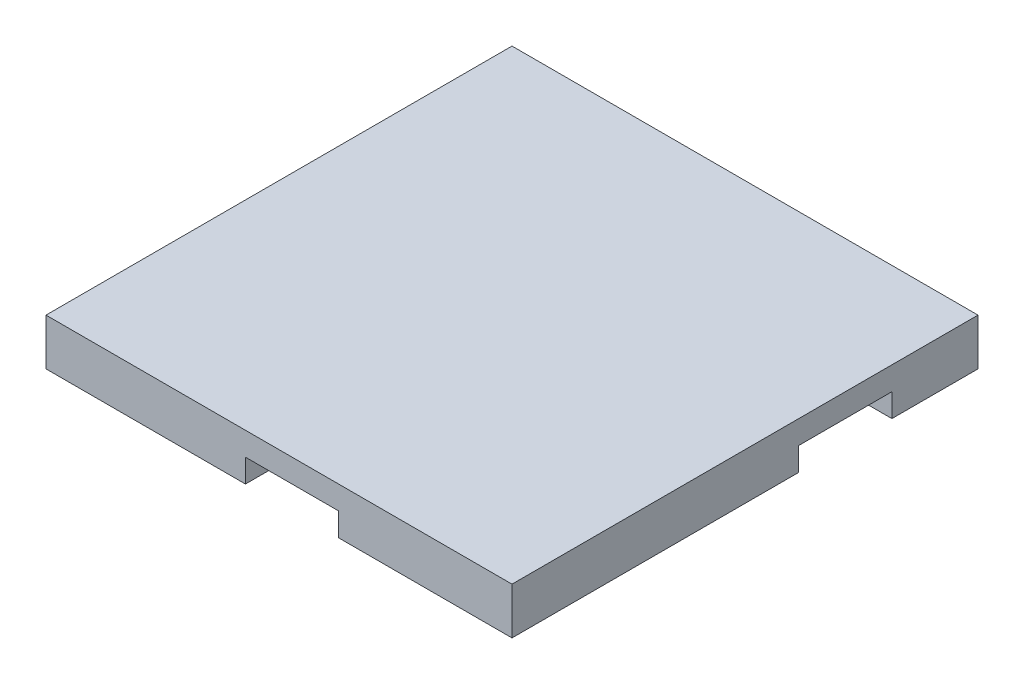
ISO-10303-21;
HEADER;
FILE_DESCRIPTION(('STEP AP214'),'2;1');
FILE_NAME('part.step','',(''),(''),'','','');
FILE_SCHEMA(('AUTOMOTIVE_DESIGN { 1 0 10303 214 1 1 1 1 }'));
ENDSEC;
DATA;
#1=APPLICATION_CONTEXT('core data for automotive mechanical design processes');
#2=APPLICATION_PROTOCOL_DEFINITION('international standard','automotive_design',2000,#1);
#3=PRODUCT_CONTEXT('',#1,'mechanical');
#4=PRODUCT('Part','Part','',(#3));
#5=PRODUCT_RELATED_PRODUCT_CATEGORY('part','',(#4));
#6=PRODUCT_DEFINITION_FORMATION('','',#4);
#7=PRODUCT_DEFINITION_CONTEXT('part definition',#1,'design');
#8=PRODUCT_DEFINITION('design','',#6,#7);
#9=PRODUCT_DEFINITION_SHAPE('','',#8);
#10=(LENGTH_UNIT() NAMED_UNIT(*) SI_UNIT(.MILLI.,.METRE.));
#11=(NAMED_UNIT(*) PLANE_ANGLE_UNIT() SI_UNIT($,.RADIAN.));
#12=(NAMED_UNIT(*) SI_UNIT($,.STERADIAN.) SOLID_ANGLE_UNIT());
#13=UNCERTAINTY_MEASURE_WITH_UNIT(LENGTH_MEASURE(1.E-05),#10,'distance_accuracy_value','');
#14=(GEOMETRIC_REPRESENTATION_CONTEXT(3) GLOBAL_UNCERTAINTY_ASSIGNED_CONTEXT((#13)) GLOBAL_UNIT_ASSIGNED_CONTEXT((#10,
#11,#12)) REPRESENTATION_CONTEXT('',''));
#15=CARTESIAN_POINT('',(0.,0.,0.));
#16=DIRECTION('',(0.,0.,1.));
#17=DIRECTION('',(1.,0.,0.));
#18=AXIS2_PLACEMENT_3D('',#15,#16,#17);
#19=CARTESIAN_POINT('',(-50.,10.,50.));
#20=DIRECTION('',(0.,0.,-1.));
#21=DIRECTION('',(-1.,0.,0.));
#22=AXIS2_PLACEMENT_3D('',#19,#20,#21);
#23=PLANE('',#22);
#24=DIRECTION('',(0.,-1.,0.));
#25=VECTOR('',#24,1.);
#26=CARTESIAN_POINT('',(-7.19895611065112,5.,50.));
#27=LINE('',#26,#25);
#28=CARTESIAN_POINT('',(-7.19895611065112,5.,50.));
#29=VERTEX_POINT('',#28);
#30=CARTESIAN_POINT('',(-7.19895611065112,0.,50.));
#31=VERTEX_POINT('',#30);
#32=EDGE_CURVE('E186',#29,#31,#27,.T.);
#33=ORIENTED_EDGE('',*,*,#32,.F.);
#34=DIRECTION('',(-1.,0.,0.));
#35=VECTOR('',#34,1.);
#36=CARTESIAN_POINT('',(-50.,5.,50.));
#37=LINE('',#36,#35);
#38=CARTESIAN_POINT('',(12.8010438893489,5.,50.));
#39=VERTEX_POINT('',#38);
#40=EDGE_CURVE('E162',#39,#29,#37,.T.);
#41=ORIENTED_EDGE('',*,*,#40,.F.);
#42=DIRECTION('',(0.,-1.,0.));
#43=VECTOR('',#42,1.);
#44=CARTESIAN_POINT('',(12.8010438893489,5.,50.));
#45=LINE('',#44,#43);
#46=CARTESIAN_POINT('',(12.8010438893489,0.,50.));
#47=VERTEX_POINT('',#46);
#48=EDGE_CURVE('E183',#39,#47,#45,.T.);
#49=ORIENTED_EDGE('',*,*,#48,.T.);
#50=DIRECTION('',(1.,0.,0.));
#51=VECTOR('',#50,1.);
#52=CARTESIAN_POINT('',(-50.,0.,50.));
#53=LINE('',#52,#51);
#54=CARTESIAN_POINT('',(50.,0.,50.));
#55=VERTEX_POINT('',#54);
#56=EDGE_CURVE('E204',#47,#55,#53,.T.);
#57=ORIENTED_EDGE('',*,*,#56,.T.);
#58=DIRECTION('',(0.,-1.,0.));
#59=VECTOR('',#58,1.);
#60=CARTESIAN_POINT('',(50.,10.,50.));
#61=LINE('',#60,#59);
#62=CARTESIAN_POINT('',(50.,10.,50.));
#63=VERTEX_POINT('',#62);
#64=EDGE_CURVE('E214',#63,#55,#61,.T.);
#65=ORIENTED_EDGE('',*,*,#64,.F.);
#66=DIRECTION('',(1.,0.,0.));
#67=VECTOR('',#66,1.);
#68=CARTESIAN_POINT('',(-50.,10.,50.));
#69=LINE('',#68,#67);
#70=CARTESIAN_POINT('',(-50.,10.,50.));
#71=VERTEX_POINT('',#70);
#72=EDGE_CURVE('E86',#71,#63,#69,.T.);
#73=ORIENTED_EDGE('',*,*,#72,.F.);
#74=DIRECTION('',(0.,-1.,0.));
#75=VECTOR('',#74,1.);
#76=CARTESIAN_POINT('',(-50.,10.,50.));
#77=LINE('',#76,#75);
#78=CARTESIAN_POINT('',(-50.,0.,50.));
#79=VERTEX_POINT('',#78);
#80=EDGE_CURVE('E41',#71,#79,#77,.T.);
#81=ORIENTED_EDGE('',*,*,#80,.T.);
#82=EDGE_CURVE('E205',#79,#31,#53,.T.);
#83=ORIENTED_EDGE('',*,*,#82,.T.);
#84=EDGE_LOOP('',(#33,#41,#49,#57,#65,#73,#81,#83));
#85=FACE_BOUND('',#84,.T.);
#86=ADVANCED_FACE('F33',(#85),#23,.F.);
#87=CARTESIAN_POINT('',(50.,10.,-50.));
#88=DIRECTION('',(-1.,0.,0.));
#89=DIRECTION('',(0.,0.,1.));
#90=AXIS2_PLACEMENT_3D('',#87,#88,#89);
#91=PLANE('',#90);
#92=DIRECTION('',(0.,-1.,0.));
#93=VECTOR('',#92,1.);
#94=CARTESIAN_POINT('',(50.,5.,-31.5216324904191));
#95=LINE('',#94,#93);
#96=CARTESIAN_POINT('',(50.,5.,-31.5216324904191));
#97=VERTEX_POINT('',#96);
#98=CARTESIAN_POINT('',(50.,0.,-31.5216324904191));
#99=VERTEX_POINT('',#98);
#100=EDGE_CURVE('E156',#97,#99,#95,.T.);
#101=ORIENTED_EDGE('',*,*,#100,.T.);
#102=DIRECTION('',(0.,0.,-1.));
#103=VECTOR('',#102,1.);
#104=CARTESIAN_POINT('',(50.,0.,-50.));
#105=LINE('',#104,#103);
#106=CARTESIAN_POINT('',(50.,0.,-50.));
#107=VERTEX_POINT('',#106);
#108=EDGE_CURVE('E208',#99,#107,#105,.T.);
#109=ORIENTED_EDGE('',*,*,#108,.T.);
#110=DIRECTION('',(0.,-1.,0.));
#111=VECTOR('',#110,1.);
#112=CARTESIAN_POINT('',(50.,10.,-50.));
#113=LINE('',#112,#111);
#114=CARTESIAN_POINT('',(50.,10.,-50.));
#115=VERTEX_POINT('',#114);
#116=EDGE_CURVE('E212',#115,#107,#113,.T.);
#117=ORIENTED_EDGE('',*,*,#116,.F.);
#118=DIRECTION('',(0.,0.,-1.));
#119=VECTOR('',#118,1.);
#120=CARTESIAN_POINT('',(50.,10.,-50.));
#121=LINE('',#120,#119);
#122=EDGE_CURVE('E198',#63,#115,#121,.T.);
#123=ORIENTED_EDGE('',*,*,#122,.F.);
#124=ORIENTED_EDGE('',*,*,#64,.T.);
#125=CARTESIAN_POINT('',(50.,0.,-11.521632490419));
#126=VERTEX_POINT('',#125);
#127=EDGE_CURVE('E169',#55,#126,#105,.T.);
#128=ORIENTED_EDGE('',*,*,#127,.T.);
#129=DIRECTION('',(0.,-1.,0.));
#130=VECTOR('',#129,1.);
#131=CARTESIAN_POINT('',(50.,5.,-11.5216324904191));
#132=LINE('',#131,#130);
#133=CARTESIAN_POINT('',(50.,5.,-11.5216324904191));
#134=VERTEX_POINT('',#133);
#135=EDGE_CURVE('E48',#134,#126,#132,.T.);
#136=ORIENTED_EDGE('',*,*,#135,.F.);
#137=DIRECTION('',(0.,0.,1.));
#138=VECTOR('',#137,1.);
#139=CARTESIAN_POINT('',(50.,5.,-50.));
#140=LINE('',#139,#138);
#141=EDGE_CURVE('E11',#97,#134,#140,.T.);
#142=ORIENTED_EDGE('',*,*,#141,.F.);
#143=EDGE_LOOP('',(#101,#109,#117,#123,#124,#128,#136,#142));
#144=FACE_BOUND('',#143,.T.);
#145=ADVANCED_FACE('F165',(#144),#91,.F.);
#146=CARTESIAN_POINT('',(0.,0.,0.));
#147=DIRECTION('',(0.,1.,0.));
#148=DIRECTION('',(0.,0.,1.));
#149=AXIS2_PLACEMENT_3D('',#146,#147,#148);
#150=PLANE('',#149);
#151=DIRECTION('',(-1.,0.,0.));
#152=VECTOR('',#151,1.);
#153=CARTESIAN_POINT('',(50.,0.,-31.5216324904191));
#154=LINE('',#153,#152);
#155=CARTESIAN_POINT('',(-35.5610445751699,0.,-31.5216324904191));
#156=VERTEX_POINT('',#155);
#157=EDGE_CURVE('E159',#99,#156,#154,.T.);
#158=ORIENTED_EDGE('',*,*,#157,.T.);
#159=DIRECTION('',(0.,0.,1.));
#160=VECTOR('',#159,1.);
#161=CARTESIAN_POINT('',(-35.5610445751699,0.,-31.5216324904191));
#162=LINE('',#161,#160);
#163=CARTESIAN_POINT('',(-35.5610445751699,0.,22.4260167817738));
#164=VERTEX_POINT('',#163);
#165=EDGE_CURVE('E236',#156,#164,#162,.T.);
#166=ORIENTED_EDGE('',*,*,#165,.T.);
#167=DIRECTION('',(1.,0.,0.));
#168=VECTOR('',#167,1.);
#169=CARTESIAN_POINT('',(-35.5610445751699,0.,22.4260167817738));
#170=LINE('',#169,#168);
#171=CARTESIAN_POINT('',(-7.19895611065112,0.,22.4260167817738));
#172=VERTEX_POINT('',#171);
#173=EDGE_CURVE('E228',#164,#172,#170,.T.);
#174=ORIENTED_EDGE('',*,*,#173,.T.);
#175=DIRECTION('',(0.,0.,1.));
#176=VECTOR('',#175,1.);
#177=CARTESIAN_POINT('',(-7.19895611065112,0.,22.4260167817738));
#178=LINE('',#177,#176);
#179=EDGE_CURVE('E225',#172,#31,#178,.T.);
#180=ORIENTED_EDGE('',*,*,#179,.T.);
#181=ORIENTED_EDGE('',*,*,#82,.F.);
#182=DIRECTION('',(0.,0.,1.));
#183=VECTOR('',#182,1.);
#184=CARTESIAN_POINT('',(-50.,0.,-50.));
#185=LINE('',#184,#183);
#186=CARTESIAN_POINT('',(-50.,0.,-50.));
#187=VERTEX_POINT('',#186);
#188=EDGE_CURVE('E194',#187,#79,#185,.T.);
#189=ORIENTED_EDGE('',*,*,#188,.F.);
#190=DIRECTION('',(-1.,0.,0.));
#191=VECTOR('',#190,1.);
#192=CARTESIAN_POINT('',(-50.,0.,-50.));
#193=LINE('',#192,#191);
#194=EDGE_CURVE('E78',#107,#187,#193,.T.);
#195=ORIENTED_EDGE('',*,*,#194,.F.);
#196=ORIENTED_EDGE('',*,*,#108,.F.);
#197=EDGE_LOOP('',(#158,#166,#174,#180,#181,#189,#195,#196));
#198=FACE_BOUND('',#197,.T.);
#199=ADVANCED_FACE('F221',(#198),#150,.F.);
#200=DIRECTION('',(0.,0.,-1.));
#201=VECTOR('',#200,1.);
#202=CARTESIAN_POINT('',(12.8010438893489,0.,2.4260167817738));
#203=LINE('',#202,#201);
#204=CARTESIAN_POINT('',(12.8010438893489,0.,2.4260167817738));
#205=VERTEX_POINT('',#204);
#206=EDGE_CURVE('E231',#47,#205,#203,.T.);
#207=ORIENTED_EDGE('',*,*,#206,.T.);
#208=DIRECTION('',(-1.,0.,0.));
#209=VECTOR('',#208,1.);
#210=CARTESIAN_POINT('',(-15.5610445751699,0.,2.4260167817738));
#211=LINE('',#210,#209);
#212=CARTESIAN_POINT('',(-15.5610445751699,0.,2.4260167817738));
#213=VERTEX_POINT('',#212);
#214=EDGE_CURVE('E234',#205,#213,#211,.T.);
#215=ORIENTED_EDGE('',*,*,#214,.T.);
#216=DIRECTION('',(0.,0.,-1.));
#217=VECTOR('',#216,1.);
#218=CARTESIAN_POINT('',(-15.5610445751699,0.,-11.5216324904191));
#219=LINE('',#218,#217);
#220=CARTESIAN_POINT('',(-15.5610445751699,0.,-11.5216324904191));
#221=VERTEX_POINT('',#220);
#222=EDGE_CURVE('E241',#213,#221,#219,.T.);
#223=ORIENTED_EDGE('',*,*,#222,.T.);
#224=DIRECTION('',(1.,0.,0.));
#225=VECTOR('',#224,1.);
#226=CARTESIAN_POINT('',(50.,0.,-11.5216324904191));
#227=LINE('',#226,#225);
#228=EDGE_CURVE('E153',#221,#126,#227,.T.);
#229=ORIENTED_EDGE('',*,*,#228,.T.);
#230=ORIENTED_EDGE('',*,*,#127,.F.);
#231=ORIENTED_EDGE('',*,*,#56,.F.);
#232=EDGE_LOOP('',(#207,#215,#223,#229,#230,#231));
#233=FACE_BOUND('',#232,.T.);
#234=ADVANCED_FACE('F245',(#233),#150,.F.);
#235=CARTESIAN_POINT('',(-50.,10.,-50.));
#236=DIRECTION('',(1.,0.,0.));
#237=DIRECTION('',(0.,0.,-1.));
#238=AXIS2_PLACEMENT_3D('',#235,#236,#237);
#239=PLANE('',#238);
#240=ORIENTED_EDGE('',*,*,#188,.T.);
#241=ORIENTED_EDGE('',*,*,#80,.F.);
#242=DIRECTION('',(0.,0.,1.));
#243=VECTOR('',#242,1.);
#244=CARTESIAN_POINT('',(-50.,10.,-50.));
#245=LINE('',#244,#243);
#246=CARTESIAN_POINT('',(-50.,10.,-50.));
#247=VERTEX_POINT('',#246);
#248=EDGE_CURVE('E195',#247,#71,#245,.T.);
#249=ORIENTED_EDGE('',*,*,#248,.F.);
#250=DIRECTION('',(0.,-1.,0.));
#251=VECTOR('',#250,1.);
#252=CARTESIAN_POINT('',(-50.,10.,-50.));
#253=LINE('',#252,#251);
#254=EDGE_CURVE('E201',#247,#187,#253,.T.);
#255=ORIENTED_EDGE('',*,*,#254,.T.);
#256=EDGE_LOOP('',(#240,#241,#249,#255));
#257=FACE_BOUND('',#256,.T.);
#258=ADVANCED_FACE('F35',(#257),#239,.F.);
#259=CARTESIAN_POINT('',(-50.,10.,-50.));
#260=DIRECTION('',(0.,0.,1.));
#261=DIRECTION('',(1.,0.,0.));
#262=AXIS2_PLACEMENT_3D('',#259,#260,#261);
#263=PLANE('',#262);
#264=ORIENTED_EDGE('',*,*,#194,.T.);
#265=ORIENTED_EDGE('',*,*,#254,.F.);
#266=DIRECTION('',(-1.,0.,0.));
#267=VECTOR('',#266,1.);
#268=CARTESIAN_POINT('',(-50.,10.,-50.));
#269=LINE('',#268,#267);
#270=EDGE_CURVE('E57',#115,#247,#269,.T.);
#271=ORIENTED_EDGE('',*,*,#270,.F.);
#272=ORIENTED_EDGE('',*,*,#116,.T.);
#273=EDGE_LOOP('',(#264,#265,#271,#272));
#274=FACE_BOUND('',#273,.T.);
#275=ADVANCED_FACE('F285',(#274),#263,.F.);
#276=CARTESIAN_POINT('',(0.,10.,0.));
#277=DIRECTION('',(0.,1.,0.));
#278=DIRECTION('',(0.,0.,1.));
#279=AXIS2_PLACEMENT_3D('',#276,#277,#278);
#280=PLANE('',#279);
#281=ORIENTED_EDGE('',*,*,#248,.T.);
#282=ORIENTED_EDGE('',*,*,#72,.T.);
#283=ORIENTED_EDGE('',*,*,#122,.T.);
#284=ORIENTED_EDGE('',*,*,#270,.T.);
#285=EDGE_LOOP('',(#281,#282,#283,#284));
#286=FACE_BOUND('',#285,.T.);
#287=ADVANCED_FACE('F283',(#286),#280,.T.);
#288=CARTESIAN_POINT('',(50.,5.,-21.5216324904191));
#289=DIRECTION('',(0.,-1.,0.));
#290=DIRECTION('',(0.,0.,-1.));
#291=AXIS2_PLACEMENT_3D('',#288,#289,#290);
#292=PLANE('',#291);
#293=ORIENTED_EDGE('',*,*,#40,.T.);
#294=DIRECTION('',(0.,0.,1.));
#295=VECTOR('',#294,1.);
#296=CARTESIAN_POINT('',(-7.19895611065112,5.,22.4260167817738));
#297=LINE('',#296,#295);
#298=CARTESIAN_POINT('',(-7.19895611065112,5.,22.4260167817738));
#299=VERTEX_POINT('',#298);
#300=EDGE_CURVE('E270',#299,#29,#297,.T.);
#301=ORIENTED_EDGE('',*,*,#300,.F.);
#302=DIRECTION('',(1.,0.,0.));
#303=VECTOR('',#302,1.);
#304=CARTESIAN_POINT('',(-35.5610445751699,5.,22.4260167817738));
#305=LINE('',#304,#303);
#306=CARTESIAN_POINT('',(-35.5610445751699,5.,22.4260167817738));
#307=VERTEX_POINT('',#306);
#308=EDGE_CURVE('E266',#307,#299,#305,.T.);
#309=ORIENTED_EDGE('',*,*,#308,.F.);
#310=DIRECTION('',(0.,0.,1.));
#311=VECTOR('',#310,1.);
#312=CARTESIAN_POINT('',(-35.5610445751699,5.,-31.5216324904191));
#313=LINE('',#312,#311);
#314=CARTESIAN_POINT('',(-35.5610445751699,5.,-31.5216324904191));
#315=VERTEX_POINT('',#314);
#316=EDGE_CURVE('E150',#315,#307,#313,.T.);
#317=ORIENTED_EDGE('',*,*,#316,.F.);
#318=DIRECTION('',(-1.,0.,0.));
#319=VECTOR('',#318,1.);
#320=CARTESIAN_POINT('',(50.,5.,-31.5216324904191));
#321=LINE('',#320,#319);
#322=EDGE_CURVE('E144',#97,#315,#321,.T.);
#323=ORIENTED_EDGE('',*,*,#322,.F.);
#324=ORIENTED_EDGE('',*,*,#141,.T.);
#325=DIRECTION('',(1.,0.,0.));
#326=VECTOR('',#325,1.);
#327=CARTESIAN_POINT('',(50.,5.,-11.5216324904191));
#328=LINE('',#327,#326);
#329=CARTESIAN_POINT('',(-15.5610445751699,5.,-11.5216324904191));
#330=VERTEX_POINT('',#329);
#331=EDGE_CURVE('E171',#330,#134,#328,.T.);
#332=ORIENTED_EDGE('',*,*,#331,.F.);
#333=DIRECTION('',(0.,0.,-1.));
#334=VECTOR('',#333,1.);
#335=CARTESIAN_POINT('',(-15.5610445751699,5.,-11.5216324904191));
#336=LINE('',#335,#334);
#337=CARTESIAN_POINT('',(-15.5610445751699,5.,2.4260167817738));
#338=VERTEX_POINT('',#337);
#339=EDGE_CURVE('E175',#338,#330,#336,.T.);
#340=ORIENTED_EDGE('',*,*,#339,.F.);
#341=DIRECTION('',(-1.,0.,0.));
#342=VECTOR('',#341,1.);
#343=CARTESIAN_POINT('',(-15.5610445751699,5.,2.4260167817738));
#344=LINE('',#343,#342);
#345=CARTESIAN_POINT('',(12.8010438893489,5.,2.4260167817738));
#346=VERTEX_POINT('',#345);
#347=EDGE_CURVE('E253',#346,#338,#344,.T.);
#348=ORIENTED_EDGE('',*,*,#347,.F.);
#349=DIRECTION('',(0.,0.,-1.));
#350=VECTOR('',#349,1.);
#351=CARTESIAN_POINT('',(12.8010438893489,5.,2.4260167817738));
#352=LINE('',#351,#350);
#353=EDGE_CURVE('E256',#39,#346,#352,.T.);
#354=ORIENTED_EDGE('',*,*,#353,.F.);
#355=EDGE_LOOP('',(#293,#301,#309,#317,#323,#324,#332,#340,#348,#354));
#356=FACE_BOUND('',#355,.T.);
#357=ADVANCED_FACE('F146',(#356),#292,.T.);
#358=CARTESIAN_POINT('',(50.,5.,-31.5216324904191));
#359=DIRECTION('',(0.,0.,1.));
#360=DIRECTION('',(1.,0.,0.));
#361=AXIS2_PLACEMENT_3D('',#358,#359,#360);
#362=PLANE('',#361);
#363=ORIENTED_EDGE('',*,*,#157,.F.);
#364=ORIENTED_EDGE('',*,*,#100,.F.);
#365=ORIENTED_EDGE('',*,*,#322,.T.);
#366=DIRECTION('',(0.,-1.,0.));
#367=VECTOR('',#366,1.);
#368=CARTESIAN_POINT('',(-35.5610445751699,5.,-31.5216324904191));
#369=LINE('',#368,#367);
#370=EDGE_CURVE('E163',#315,#156,#369,.T.);
#371=ORIENTED_EDGE('',*,*,#370,.T.);
#372=EDGE_LOOP('',(#363,#364,#365,#371));
#373=FACE_BOUND('',#372,.T.);
#374=ADVANCED_FACE('F157',(#373),#362,.T.);
#375=CARTESIAN_POINT('',(-35.5610445751699,5.,-31.5216324904191));
#376=DIRECTION('',(1.,0.,0.));
#377=DIRECTION('',(0.,0.,-1.));
#378=AXIS2_PLACEMENT_3D('',#375,#376,#377);
#379=PLANE('',#378);
#380=ORIENTED_EDGE('',*,*,#165,.F.);
#381=ORIENTED_EDGE('',*,*,#370,.F.);
#382=ORIENTED_EDGE('',*,*,#316,.T.);
#383=DIRECTION('',(0.,-1.,0.));
#384=VECTOR('',#383,1.);
#385=CARTESIAN_POINT('',(-35.5610445751699,5.,22.4260167817738));
#386=LINE('',#385,#384);
#387=EDGE_CURVE('E190',#307,#164,#386,.T.);
#388=ORIENTED_EDGE('',*,*,#387,.T.);
#389=EDGE_LOOP('',(#380,#381,#382,#388));
#390=FACE_BOUND('',#389,.T.);
#391=ADVANCED_FACE('F262',(#390),#379,.T.);
#392=CARTESIAN_POINT('',(-35.5610445751699,5.,22.4260167817738));
#393=DIRECTION('',(0.,0.,-1.));
#394=DIRECTION('',(-1.,0.,0.));
#395=AXIS2_PLACEMENT_3D('',#392,#393,#394);
#396=PLANE('',#395);
#397=ORIENTED_EDGE('',*,*,#173,.F.);
#398=ORIENTED_EDGE('',*,*,#387,.F.);
#399=ORIENTED_EDGE('',*,*,#308,.T.);
#400=DIRECTION('',(0.,-1.,0.));
#401=VECTOR('',#400,1.);
#402=CARTESIAN_POINT('',(-7.19895611065112,5.,22.4260167817738));
#403=LINE('',#402,#401);
#404=EDGE_CURVE('E188',#299,#172,#403,.T.);
#405=ORIENTED_EDGE('',*,*,#404,.T.);
#406=EDGE_LOOP('',(#397,#398,#399,#405));
#407=FACE_BOUND('',#406,.T.);
#408=ADVANCED_FACE('F265',(#407),#396,.T.);
#409=CARTESIAN_POINT('',(-7.19895611065112,5.,22.4260167817738));
#410=DIRECTION('',(1.,0.,0.));
#411=DIRECTION('',(0.,0.,-1.));
#412=AXIS2_PLACEMENT_3D('',#409,#410,#411);
#413=PLANE('',#412);
#414=ORIENTED_EDGE('',*,*,#179,.F.);
#415=ORIENTED_EDGE('',*,*,#404,.F.);
#416=ORIENTED_EDGE('',*,*,#300,.T.);
#417=ORIENTED_EDGE('',*,*,#32,.T.);
#418=EDGE_LOOP('',(#414,#415,#416,#417));
#419=FACE_BOUND('',#418,.T.);
#420=ADVANCED_FACE('F269',(#419),#413,.T.);
#421=CARTESIAN_POINT('',(12.8010438893489,5.,2.4260167817738));
#422=DIRECTION('',(-1.,0.,0.));
#423=DIRECTION('',(0.,0.,1.));
#424=AXIS2_PLACEMENT_3D('',#421,#422,#423);
#425=PLANE('',#424);
#426=ORIENTED_EDGE('',*,*,#206,.F.);
#427=ORIENTED_EDGE('',*,*,#48,.F.);
#428=ORIENTED_EDGE('',*,*,#353,.T.);
#429=DIRECTION('',(0.,-1.,0.));
#430=VECTOR('',#429,1.);
#431=CARTESIAN_POINT('',(12.8010438893489,5.,2.4260167817738));
#432=LINE('',#431,#430);
#433=EDGE_CURVE('E181',#346,#205,#432,.T.);
#434=ORIENTED_EDGE('',*,*,#433,.T.);
#435=EDGE_LOOP('',(#426,#427,#428,#434));
#436=FACE_BOUND('',#435,.T.);
#437=ADVANCED_FACE('F277',(#436),#425,.T.);
#438=CARTESIAN_POINT('',(-15.5610445751699,5.,2.4260167817738));
#439=DIRECTION('',(0.,0.,1.));
#440=DIRECTION('',(1.,0.,0.));
#441=AXIS2_PLACEMENT_3D('',#438,#439,#440);
#442=PLANE('',#441);
#443=ORIENTED_EDGE('',*,*,#214,.F.);
#444=ORIENTED_EDGE('',*,*,#433,.F.);
#445=ORIENTED_EDGE('',*,*,#347,.T.);
#446=DIRECTION('',(0.,-1.,0.));
#447=VECTOR('',#446,1.);
#448=CARTESIAN_POINT('',(-15.5610445751699,5.,2.4260167817738));
#449=LINE('',#448,#447);
#450=EDGE_CURVE('E173',#338,#213,#449,.T.);
#451=ORIENTED_EDGE('',*,*,#450,.T.);
#452=EDGE_LOOP('',(#443,#444,#445,#451));
#453=FACE_BOUND('',#452,.T.);
#454=ADVANCED_FACE('F280',(#453),#442,.T.);
#455=CARTESIAN_POINT('',(-15.5610445751699,5.,-11.5216324904191));
#456=DIRECTION('',(-1.,0.,0.));
#457=DIRECTION('',(0.,0.,1.));
#458=AXIS2_PLACEMENT_3D('',#455,#456,#457);
#459=PLANE('',#458);
#460=ORIENTED_EDGE('',*,*,#222,.F.);
#461=ORIENTED_EDGE('',*,*,#450,.F.);
#462=ORIENTED_EDGE('',*,*,#339,.T.);
#463=DIRECTION('',(0.,-1.,0.));
#464=VECTOR('',#463,1.);
#465=CARTESIAN_POINT('',(-15.5610445751699,5.,-11.5216324904191));
#466=LINE('',#465,#464);
#467=EDGE_CURVE('E170',#330,#221,#466,.T.);
#468=ORIENTED_EDGE('',*,*,#467,.T.);
#469=EDGE_LOOP('',(#460,#461,#462,#468));
#470=FACE_BOUND('',#469,.T.);
#471=ADVANCED_FACE('F389',(#470),#459,.T.);
#472=CARTESIAN_POINT('',(50.,5.,-11.5216324904191));
#473=DIRECTION('',(0.,0.,-1.));
#474=DIRECTION('',(-1.,0.,0.));
#475=AXIS2_PLACEMENT_3D('',#472,#473,#474);
#476=PLANE('',#475);
#477=ORIENTED_EDGE('',*,*,#228,.F.);
#478=ORIENTED_EDGE('',*,*,#467,.F.);
#479=ORIENTED_EDGE('',*,*,#331,.T.);
#480=ORIENTED_EDGE('',*,*,#135,.T.);
#481=EDGE_LOOP('',(#477,#478,#479,#480));
#482=FACE_BOUND('',#481,.T.);
#483=ADVANCED_FACE('F248',(#482),#476,.T.);
#484=CLOSED_SHELL('',(#86,#145,#199,#234,#258,#275,#287,#357,#374,#391,#408,#420,#437,#454,#471,#483));
#485=MANIFOLD_SOLID_BREP('B2',#484);
#486=ADVANCED_BREP_SHAPE_REPRESENTATION('',(#18,#485),#14);
#487=SHAPE_DEFINITION_REPRESENTATION(#9,#486);
ENDSEC;
END-ISO-10303-21;
